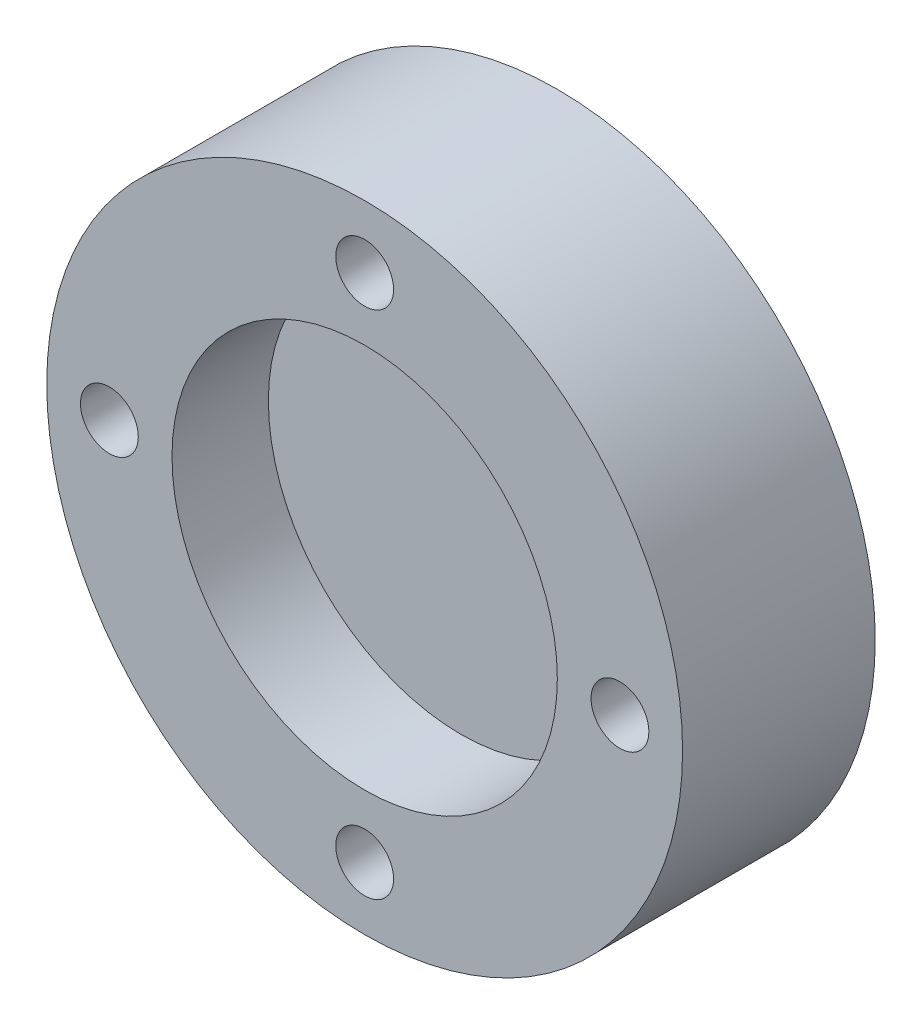
ISO-10303-21;
HEADER;
FILE_DESCRIPTION(('STEP AP214'),'2;1');
FILE_NAME('part.step','',(''),(''),'','','');
FILE_SCHEMA(('AUTOMOTIVE_DESIGN { 1 0 10303 214 1 1 1 1 }'));
ENDSEC;
DATA;
#1=APPLICATION_CONTEXT('core data for automotive mechanical design processes');
#2=APPLICATION_PROTOCOL_DEFINITION('international standard','automotive_design',2000,#1);
#3=PRODUCT_CONTEXT('',#1,'mechanical');
#4=PRODUCT('Part','Part','',(#3));
#5=PRODUCT_RELATED_PRODUCT_CATEGORY('part','',(#4));
#6=PRODUCT_DEFINITION_FORMATION('','',#4);
#7=PRODUCT_DEFINITION_CONTEXT('part definition',#1,'design');
#8=PRODUCT_DEFINITION('design','',#6,#7);
#9=PRODUCT_DEFINITION_SHAPE('','',#8);
#10=(LENGTH_UNIT() NAMED_UNIT(*) SI_UNIT(.MILLI.,.METRE.));
#11=(NAMED_UNIT(*) PLANE_ANGLE_UNIT() SI_UNIT($,.RADIAN.));
#12=(NAMED_UNIT(*) SI_UNIT($,.STERADIAN.) SOLID_ANGLE_UNIT());
#13=UNCERTAINTY_MEASURE_WITH_UNIT(LENGTH_MEASURE(1.E-05),#10,'distance_accuracy_value','');
#14=(GEOMETRIC_REPRESENTATION_CONTEXT(3) GLOBAL_UNCERTAINTY_ASSIGNED_CONTEXT((#13)) GLOBAL_UNIT_ASSIGNED_CONTEXT((#10,
#11,#12)) REPRESENTATION_CONTEXT('',''));
#15=CARTESIAN_POINT('',(0.,0.,0.));
#16=DIRECTION('',(0.,0.,1.));
#17=DIRECTION('',(1.,0.,0.));
#18=AXIS2_PLACEMENT_3D('',#15,#16,#17);
#19=CARTESIAN_POINT('',(0.,0.,-5.));
#20=DIRECTION('',(0.,0.,-1.));
#21=DIRECTION('',(-1.,0.,0.));
#22=AXIS2_PLACEMENT_3D('',#19,#20,#21);
#23=CYLINDRICAL_SURFACE('',#22,9.99800620364836);
#24=CARTESIAN_POINT('',(0.,0.,-5.));
#25=DIRECTION('',(0.,0.,-1.));
#26=DIRECTION('',(-1.,0.,0.));
#27=AXIS2_PLACEMENT_3D('',#24,#25,#26);
#28=CIRCLE('',#27,9.99800620364836);
#29=CARTESIAN_POINT('',(-9.99800620364836,0.,-5.));
#30=VERTEX_POINT('',#29);
#31=EDGE_CURVE('E11',#30,#30,#28,.T.);
#32=ORIENTED_EDGE('',*,*,#31,.T.);
#33=EDGE_LOOP('',(#32));
#34=FACE_BOUND('',#33,.T.);
#35=CARTESIAN_POINT('',(0.,0.,-12.));
#36=DIRECTION('',(0.,0.,-1.));
#37=DIRECTION('',(-1.,0.,0.));
#38=AXIS2_PLACEMENT_3D('',#35,#36,#37);
#39=CIRCLE('',#38,9.99800620364836);
#40=CARTESIAN_POINT('',(-9.99800620364836,0.,-12.));
#41=VERTEX_POINT('',#40);
#42=EDGE_CURVE('E46',#41,#41,#39,.T.);
#43=ORIENTED_EDGE('',*,*,#42,.F.);
#44=EDGE_LOOP('',(#43));
#45=FACE_BOUND('',#44,.T.);
#46=ADVANCED_FACE('F40',(#34,#45),#23,.T.);
#47=CARTESIAN_POINT('',(0.,0.,-5.));
#48=DIRECTION('',(0.,0.,-1.));
#49=DIRECTION('',(-1.,0.,0.));
#50=AXIS2_PLACEMENT_3D('',#47,#48,#49);
#51=PLANE('',#50);
#52=ORIENTED_EDGE('',*,*,#31,.F.);
#53=EDGE_LOOP('',(#52));
#54=FACE_BOUND('',#53,.T.);
#55=ADVANCED_FACE('F55',(#54),#51,.F.);
#56=CARTESIAN_POINT('',(0.,0.,-12.));
#57=DIRECTION('',(0.,0.,-1.));
#58=DIRECTION('',(-1.,0.,0.));
#59=AXIS2_PLACEMENT_3D('',#56,#57,#58);
#60=PLANE('',#59);
#61=ORIENTED_EDGE('',*,*,#42,.T.);
#62=EDGE_LOOP('',(#61));
#63=FACE_BOUND('',#62,.T.);
#64=ADVANCED_FACE('F52',(#63),#60,.T.);
#65=CLOSED_SHELL('',(#46,#55,#64));
#66=MANIFOLD_SOLID_BREP('B2',#65);
#67=CARTESIAN_POINT('',(0.,0.,-10.));
#68=DIRECTION('',(0.,0.,1.));
#69=DIRECTION('',(1.,0.,0.));
#70=AXIS2_PLACEMENT_3D('',#67,#68,#69);
#71=CYLINDRICAL_SURFACE('',#70,16.5);
#72=CARTESIAN_POINT('',(0.,0.,-10.));
#73=DIRECTION('',(0.,0.,1.));
#74=DIRECTION('',(1.,0.,0.));
#75=AXIS2_PLACEMENT_3D('',#72,#73,#74);
#76=CIRCLE('',#75,16.5);
#77=CARTESIAN_POINT('',(16.5,0.,-10.));
#78=VERTEX_POINT('',#77);
#79=EDGE_CURVE('E39',#78,#78,#76,.T.);
#80=ORIENTED_EDGE('',*,*,#79,.T.);
#81=EDGE_LOOP('',(#80));
#82=FACE_BOUND('',#81,.T.);
#83=CARTESIAN_POINT('',(0.,0.,0.));
#84=DIRECTION('',(0.,0.,1.));
#85=DIRECTION('',(1.,0.,0.));
#86=AXIS2_PLACEMENT_3D('',#83,#84,#85);
#87=CIRCLE('',#86,16.5);
#88=CARTESIAN_POINT('',(16.5,0.,0.));
#89=VERTEX_POINT('',#88);
#90=EDGE_CURVE('E86',#89,#89,#87,.T.);
#91=ORIENTED_EDGE('',*,*,#90,.F.);
#92=EDGE_LOOP('',(#91));
#93=FACE_BOUND('',#92,.T.);
#94=ADVANCED_FACE('F83',(#82,#93),#71,.T.);
#95=CARTESIAN_POINT('',(0.,0.,-10.));
#96=DIRECTION('',(0.,0.,1.));
#97=DIRECTION('',(1.,0.,0.));
#98=AXIS2_PLACEMENT_3D('',#95,#96,#97);
#99=PLANE('',#98);
#100=CARTESIAN_POINT('',(-13.25,0.,-10.));
#101=DIRECTION('',(0.,0.,1.));
#102=DIRECTION('',(1.,0.,0.));
#103=AXIS2_PLACEMENT_3D('',#100,#101,#102);
#104=CIRCLE('',#103,1.5);
#105=CARTESIAN_POINT('',(-11.75,0.,-10.));
#106=VERTEX_POINT('',#105);
#107=EDGE_CURVE('E116',#106,#106,#104,.T.);
#108=ORIENTED_EDGE('',*,*,#107,.T.);
#109=EDGE_LOOP('',(#108));
#110=FACE_BOUND('',#109,.T.);
#111=CARTESIAN_POINT('',(0.,-13.25,-10.));
#112=DIRECTION('',(0.,0.,1.));
#113=DIRECTION('',(1.,0.,0.));
#114=AXIS2_PLACEMENT_3D('',#111,#112,#113);
#115=CIRCLE('',#114,1.5);
#116=CARTESIAN_POINT('',(1.5,-13.25,-10.));
#117=VERTEX_POINT('',#116);
#118=EDGE_CURVE('E110',#117,#117,#115,.T.);
#119=ORIENTED_EDGE('',*,*,#118,.T.);
#120=EDGE_LOOP('',(#119));
#121=FACE_BOUND('',#120,.T.);
#122=CARTESIAN_POINT('',(13.25,0.,-10.));
#123=DIRECTION('',(0.,0.,1.));
#124=DIRECTION('',(1.,0.,0.));
#125=AXIS2_PLACEMENT_3D('',#122,#123,#124);
#126=CIRCLE('',#125,1.5);
#127=CARTESIAN_POINT('',(14.75,0.,-10.));
#128=VERTEX_POINT('',#127);
#129=EDGE_CURVE('E104',#128,#128,#126,.T.);
#130=ORIENTED_EDGE('',*,*,#129,.T.);
#131=EDGE_LOOP('',(#130));
#132=FACE_BOUND('',#131,.T.);
#133=CARTESIAN_POINT('',(0.,13.25,-10.));
#134=DIRECTION('',(0.,0.,1.));
#135=DIRECTION('',(1.,0.,0.));
#136=AXIS2_PLACEMENT_3D('',#133,#134,#135);
#137=CIRCLE('',#136,1.5);
#138=CARTESIAN_POINT('',(1.5,13.25,-10.));
#139=VERTEX_POINT('',#138);
#140=EDGE_CURVE('E98',#139,#139,#137,.T.);
#141=ORIENTED_EDGE('',*,*,#140,.T.);
#142=EDGE_LOOP('',(#141));
#143=FACE_BOUND('',#142,.T.);
#144=CARTESIAN_POINT('',(0.,0.,-10.));
#145=DIRECTION('',(0.,0.,1.));
#146=DIRECTION('',(1.,0.,0.));
#147=AXIS2_PLACEMENT_3D('',#144,#145,#146);
#148=CIRCLE('',#147,10.);
#149=CARTESIAN_POINT('',(10.,0.,-10.));
#150=VERTEX_POINT('',#149);
#151=EDGE_CURVE('E93',#150,#150,#148,.T.);
#152=ORIENTED_EDGE('',*,*,#151,.T.);
#153=EDGE_LOOP('',(#152));
#154=FACE_BOUND('',#153,.T.);
#155=ORIENTED_EDGE('',*,*,#79,.F.);
#156=EDGE_LOOP('',(#155));
#157=FACE_BOUND('',#156,.T.);
#158=ADVANCED_FACE('F125',(#110,#121,#132,#143,#154,#157),#99,.F.);
#159=CARTESIAN_POINT('',(0.,0.,0.));
#160=DIRECTION('',(0.,0.,1.));
#161=DIRECTION('',(1.,0.,0.));
#162=AXIS2_PLACEMENT_3D('',#159,#160,#161);
#163=PLANE('',#162);
#164=CARTESIAN_POINT('',(-13.25,0.,0.));
#165=DIRECTION('',(0.,0.,1.));
#166=DIRECTION('',(1.,0.,0.));
#167=AXIS2_PLACEMENT_3D('',#164,#165,#166);
#168=CIRCLE('',#167,1.5);
#169=CARTESIAN_POINT('',(-11.75,0.,0.));
#170=VERTEX_POINT('',#169);
#171=EDGE_CURVE('E119',#170,#170,#168,.T.);
#172=ORIENTED_EDGE('',*,*,#171,.F.);
#173=EDGE_LOOP('',(#172));
#174=FACE_BOUND('',#173,.T.);
#175=CARTESIAN_POINT('',(0.,-13.25,0.));
#176=DIRECTION('',(0.,0.,1.));
#177=DIRECTION('',(1.,0.,0.));
#178=AXIS2_PLACEMENT_3D('',#175,#176,#177);
#179=CIRCLE('',#178,1.5);
#180=CARTESIAN_POINT('',(1.5,-13.25,0.));
#181=VERTEX_POINT('',#180);
#182=EDGE_CURVE('E113',#181,#181,#179,.T.);
#183=ORIENTED_EDGE('',*,*,#182,.F.);
#184=EDGE_LOOP('',(#183));
#185=FACE_BOUND('',#184,.T.);
#186=CARTESIAN_POINT('',(13.25,0.,0.));
#187=DIRECTION('',(0.,0.,1.));
#188=DIRECTION('',(1.,0.,0.));
#189=AXIS2_PLACEMENT_3D('',#186,#187,#188);
#190=CIRCLE('',#189,1.5);
#191=CARTESIAN_POINT('',(14.75,0.,0.));
#192=VERTEX_POINT('',#191);
#193=EDGE_CURVE('E107',#192,#192,#190,.T.);
#194=ORIENTED_EDGE('',*,*,#193,.F.);
#195=EDGE_LOOP('',(#194));
#196=FACE_BOUND('',#195,.T.);
#197=CARTESIAN_POINT('',(0.,13.25,0.));
#198=DIRECTION('',(0.,0.,1.));
#199=DIRECTION('',(1.,0.,0.));
#200=AXIS2_PLACEMENT_3D('',#197,#198,#199);
#201=CIRCLE('',#200,1.5);
#202=CARTESIAN_POINT('',(1.5,13.25,0.));
#203=VERTEX_POINT('',#202);
#204=EDGE_CURVE('E101',#203,#203,#201,.T.);
#205=ORIENTED_EDGE('',*,*,#204,.F.);
#206=EDGE_LOOP('',(#205));
#207=FACE_BOUND('',#206,.T.);
#208=CARTESIAN_POINT('',(0.,0.,0.));
#209=DIRECTION('',(0.,0.,1.));
#210=DIRECTION('',(1.,0.,0.));
#211=AXIS2_PLACEMENT_3D('',#208,#209,#210);
#212=CIRCLE('',#211,10.);
#213=CARTESIAN_POINT('',(10.,0.,0.));
#214=VERTEX_POINT('',#213);
#215=EDGE_CURVE('E95',#214,#214,#212,.T.);
#216=ORIENTED_EDGE('',*,*,#215,.F.);
#217=EDGE_LOOP('',(#216));
#218=FACE_BOUND('',#217,.T.);
#219=ORIENTED_EDGE('',*,*,#90,.T.);
#220=EDGE_LOOP('',(#219));
#221=FACE_BOUND('',#220,.T.);
#222=ADVANCED_FACE('F135',(#174,#185,#196,#207,#218,#221),#163,.T.);
#223=CARTESIAN_POINT('',(0.,0.,-10.));
#224=DIRECTION('',(0.,0.,1.));
#225=DIRECTION('',(1.,0.,0.));
#226=AXIS2_PLACEMENT_3D('',#223,#224,#225);
#227=CYLINDRICAL_SURFACE('',#226,10.);
#228=ORIENTED_EDGE('',*,*,#151,.F.);
#229=EDGE_LOOP('',(#228));
#230=FACE_BOUND('',#229,.T.);
#231=ORIENTED_EDGE('',*,*,#215,.T.);
#232=EDGE_LOOP('',(#231));
#233=FACE_BOUND('',#232,.T.);
#234=ADVANCED_FACE('F138',(#230,#233),#227,.F.);
#235=CARTESIAN_POINT('',(0.,13.25,-10.));
#236=DIRECTION('',(0.,0.,1.));
#237=DIRECTION('',(1.,0.,0.));
#238=AXIS2_PLACEMENT_3D('',#235,#236,#237);
#239=CYLINDRICAL_SURFACE('',#238,1.5);
#240=ORIENTED_EDGE('',*,*,#140,.F.);
#241=EDGE_LOOP('',(#240));
#242=FACE_BOUND('',#241,.T.);
#243=ORIENTED_EDGE('',*,*,#204,.T.);
#244=EDGE_LOOP('',(#243));
#245=FACE_BOUND('',#244,.T.);
#246=ADVANCED_FACE('F159',(#242,#245),#239,.F.);
#247=CARTESIAN_POINT('',(13.25,0.,-10.));
#248=DIRECTION('',(0.,0.,1.));
#249=DIRECTION('',(1.,0.,0.));
#250=AXIS2_PLACEMENT_3D('',#247,#248,#249);
#251=CYLINDRICAL_SURFACE('',#250,1.5);
#252=ORIENTED_EDGE('',*,*,#129,.F.);
#253=EDGE_LOOP('',(#252));
#254=FACE_BOUND('',#253,.T.);
#255=ORIENTED_EDGE('',*,*,#193,.T.);
#256=EDGE_LOOP('',(#255));
#257=FACE_BOUND('',#256,.T.);
#258=ADVANCED_FACE('F163',(#254,#257),#251,.F.);
#259=CARTESIAN_POINT('',(0.,-13.25,-10.));
#260=DIRECTION('',(0.,0.,1.));
#261=DIRECTION('',(1.,0.,0.));
#262=AXIS2_PLACEMENT_3D('',#259,#260,#261);
#263=CYLINDRICAL_SURFACE('',#262,1.5);
#264=ORIENTED_EDGE('',*,*,#118,.F.);
#265=EDGE_LOOP('',(#264));
#266=FACE_BOUND('',#265,.T.);
#267=ORIENTED_EDGE('',*,*,#182,.T.);
#268=EDGE_LOOP('',(#267));
#269=FACE_BOUND('',#268,.T.);
#270=ADVANCED_FACE('F131',(#266,#269),#263,.F.);
#271=CARTESIAN_POINT('',(-13.25,0.,-10.));
#272=DIRECTION('',(0.,0.,1.));
#273=DIRECTION('',(1.,0.,0.));
#274=AXIS2_PLACEMENT_3D('',#271,#272,#273);
#275=CYLINDRICAL_SURFACE('',#274,1.5);
#276=ORIENTED_EDGE('',*,*,#107,.F.);
#277=EDGE_LOOP('',(#276));
#278=FACE_BOUND('',#277,.T.);
#279=ORIENTED_EDGE('',*,*,#171,.T.);
#280=EDGE_LOOP('',(#279));
#281=FACE_BOUND('',#280,.T.);
#282=ADVANCED_FACE('F128',(#278,#281),#275,.F.);
#283=CLOSED_SHELL('',(#94,#158,#222,#234,#246,#258,#270,#282));
#284=MANIFOLD_SOLID_BREP('B6',#283);
#285=ADVANCED_BREP_SHAPE_REPRESENTATION('',(#18,#66,#284),#14);
#286=SHAPE_DEFINITION_REPRESENTATION(#9,#285);
ENDSEC;
END-ISO-10303-21;
